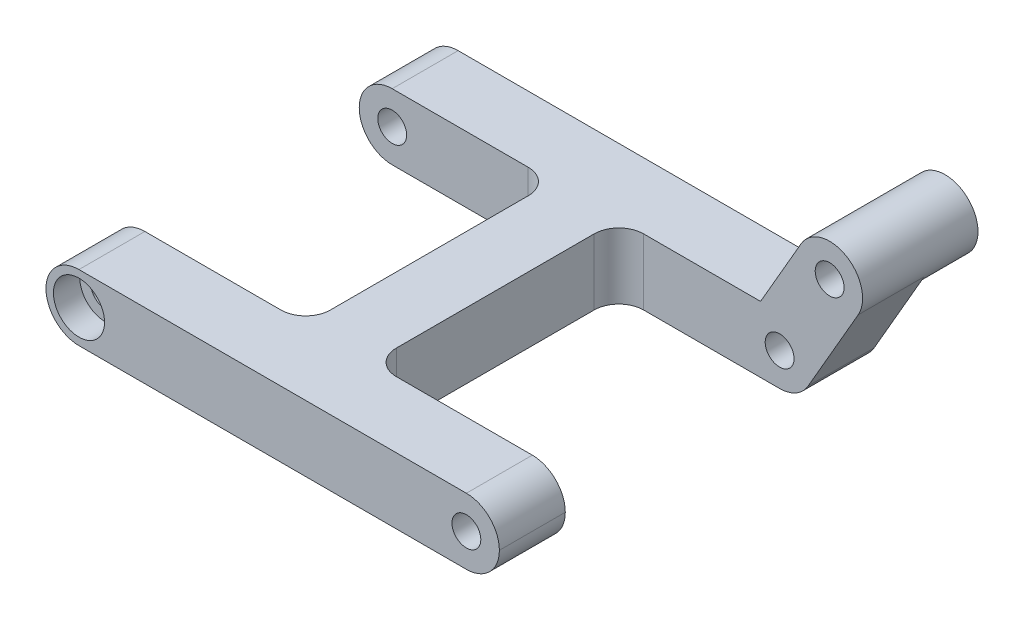
ISO-10303-21;
HEADER;
FILE_DESCRIPTION(('STEP AP214'),'2;1');
FILE_NAME('part.step','',(''),(''),'','','');
FILE_SCHEMA(('AUTOMOTIVE_DESIGN { 1 0 10303 214 1 1 1 1 }'));
ENDSEC;
DATA;
#1=APPLICATION_CONTEXT('core data for automotive mechanical design processes');
#2=APPLICATION_PROTOCOL_DEFINITION('international standard','automotive_design',2000,#1);
#3=PRODUCT_CONTEXT('',#1,'mechanical');
#4=PRODUCT('Part','Part','',(#3));
#5=PRODUCT_RELATED_PRODUCT_CATEGORY('part','',(#4));
#6=PRODUCT_DEFINITION_FORMATION('','',#4);
#7=PRODUCT_DEFINITION_CONTEXT('part definition',#1,'design');
#8=PRODUCT_DEFINITION('design','',#6,#7);
#9=PRODUCT_DEFINITION_SHAPE('','',#8);
#10=(LENGTH_UNIT() NAMED_UNIT(*) SI_UNIT(.MILLI.,.METRE.));
#11=(NAMED_UNIT(*) PLANE_ANGLE_UNIT() SI_UNIT($,.RADIAN.));
#12=(NAMED_UNIT(*) SI_UNIT($,.STERADIAN.) SOLID_ANGLE_UNIT());
#13=UNCERTAINTY_MEASURE_WITH_UNIT(LENGTH_MEASURE(1.E-05),#10,'distance_accuracy_value','');
#14=(GEOMETRIC_REPRESENTATION_CONTEXT(3) GLOBAL_UNCERTAINTY_ASSIGNED_CONTEXT((#13)) GLOBAL_UNIT_ASSIGNED_CONTEXT((#10,
#11,#12)) REPRESENTATION_CONTEXT('',''));
#15=CARTESIAN_POINT('',(0.,0.,0.));
#16=DIRECTION('',(0.,0.,1.));
#17=DIRECTION('',(1.,0.,0.));
#18=AXIS2_PLACEMENT_3D('',#15,#16,#17);
#19=CARTESIAN_POINT('',(-23.5,1.3965925355343E-13,-23.));
#20=DIRECTION('',(0.,0.,1.));
#21=DIRECTION('',(1.,0.,0.));
#22=AXIS2_PLACEMENT_3D('',#19,#20,#21);
#23=CYLINDRICAL_SURFACE('',#22,1.74999999999996);
#24=CARTESIAN_POINT('',(-23.5,1.3965925355343E-13,15.));
#25=DIRECTION('',(0.,0.,1.));
#26=DIRECTION('',(1.,0.,0.));
#27=AXIS2_PLACEMENT_3D('',#24,#25,#26);
#28=CIRCLE('',#27,1.74999999999996);
#29=CARTESIAN_POINT('',(-21.75,1.3965925355343E-13,15.));
#30=VERTEX_POINT('',#29);
#31=EDGE_CURVE('E231',#30,#30,#28,.T.);
#32=ORIENTED_EDGE('',*,*,#31,.F.);
#33=EDGE_LOOP('',(#32));
#34=FACE_BOUND('',#33,.T.);
#35=CARTESIAN_POINT('',(-23.5,1.3965925355343E-13,19.8));
#36=DIRECTION('',(0.,0.,1.));
#37=DIRECTION('',(1.,0.,0.));
#38=AXIS2_PLACEMENT_3D('',#35,#36,#37);
#39=CIRCLE('',#38,1.74999999999996);
#40=CARTESIAN_POINT('',(-21.75,1.3965925355343E-13,19.8));
#41=VERTEX_POINT('',#40);
#42=EDGE_CURVE('E40',#41,#41,#39,.F.);
#43=ORIENTED_EDGE('',*,*,#42,.F.);
#44=EDGE_LOOP('',(#43));
#45=FACE_BOUND('',#44,.T.);
#46=ADVANCED_FACE('F36',(#34,#45),#23,.F.);
#47=CARTESIAN_POINT('',(23.5,0.,-15.));
#48=DIRECTION('',(0.,0.,-1.));
#49=DIRECTION('',(-1.,0.,0.));
#50=AXIS2_PLACEMENT_3D('',#47,#48,#49);
#51=CYLINDRICAL_SURFACE('',#50,4.);
#52=CARTESIAN_POINT('',(23.5,0.,-23.));
#53=DIRECTION('',(0.,0.,1.));
#54=DIRECTION('',(1.,0.,0.));
#55=AXIS2_PLACEMENT_3D('',#52,#53,#54);
#56=CIRCLE('',#55,4.);
#57=CARTESIAN_POINT('',(26.9641016151377,-1.99999999999999,-23.));
#58=VERTEX_POINT('',#57);
#59=CARTESIAN_POINT('',(23.5,-4.,-23.));
#60=VERTEX_POINT('',#59);
#61=EDGE_CURVE('E308',#58,#60,#56,.F.);
#62=ORIENTED_EDGE('',*,*,#61,.F.);
#63=DIRECTION('',(0.,0.,-1.));
#64=VECTOR('',#63,1.);
#65=CARTESIAN_POINT('',(26.9641016151378,-1.99999999999999,-15.));
#66=LINE('',#65,#64);
#67=CARTESIAN_POINT('',(26.9641016151378,-1.99999999999999,-15.));
#68=VERTEX_POINT('',#67);
#69=EDGE_CURVE('E189',#68,#58,#66,.T.);
#70=ORIENTED_EDGE('',*,*,#69,.F.);
#71=CARTESIAN_POINT('',(23.5,0.,-15.));
#72=DIRECTION('',(0.,0.,-1.));
#73=DIRECTION('',(-1.,0.,0.));
#74=AXIS2_PLACEMENT_3D('',#71,#72,#73);
#75=CIRCLE('',#74,4.);
#76=CARTESIAN_POINT('',(23.5,-4.,-15.));
#77=VERTEX_POINT('',#76);
#78=EDGE_CURVE('E334',#77,#68,#75,.F.);
#79=ORIENTED_EDGE('',*,*,#78,.F.);
#80=DIRECTION('',(0.,0.,-1.));
#81=VECTOR('',#80,1.);
#82=CARTESIAN_POINT('',(23.5,-4.,0.));
#83=LINE('',#82,#81);
#84=EDGE_CURVE('E299',#60,#77,#83,.F.);
#85=ORIENTED_EDGE('',*,*,#84,.F.);
#86=EDGE_LOOP('',(#62,#70,#79,#85));
#87=FACE_BOUND('',#86,.T.);
#88=ADVANCED_FACE('F465',(#87),#51,.T.);
#89=CARTESIAN_POINT('',(-4.,4.,-15.));
#90=DIRECTION('',(0.,0.,-1.));
#91=DIRECTION('',(-1.,0.,0.));
#92=AXIS2_PLACEMENT_3D('',#89,#90,#91);
#93=PLANE('',#92);
#94=CARTESIAN_POINT('',(-23.5,1.3965925355343E-13,-15.));
#95=DIRECTION('',(0.,0.,-1.));
#96=DIRECTION('',(-1.,0.,0.));
#97=AXIS2_PLACEMENT_3D('',#94,#95,#96);
#98=CIRCLE('',#97,1.74999999999996);
#99=CARTESIAN_POINT('',(-25.25,1.3965925355343E-13,-15.));
#100=VERTEX_POINT('',#99);
#101=EDGE_CURVE('E241',#100,#100,#98,.T.);
#102=ORIENTED_EDGE('',*,*,#101,.T.);
#103=EDGE_LOOP('',(#102));
#104=FACE_BOUND('',#103,.T.);
#105=DIRECTION('',(1.,0.,0.));
#106=VECTOR('',#105,1.);
#107=CARTESIAN_POINT('',(-4.,-4.,-15.));
#108=LINE('',#107,#106);
#109=CARTESIAN_POINT('',(-23.5,-4.,-15.));
#110=VERTEX_POINT('',#109);
#111=CARTESIAN_POINT('',(-7.,-4.,-15.));
#112=VERTEX_POINT('',#111);
#113=EDGE_CURVE('E250',#110,#112,#108,.T.);
#114=ORIENTED_EDGE('',*,*,#113,.T.);
#115=DIRECTION('',(0.,-1.,0.));
#116=VECTOR('',#115,1.);
#117=CARTESIAN_POINT('',(-7.,4.,-15.));
#118=LINE('',#117,#116);
#119=CARTESIAN_POINT('',(-7.,4.,-15.));
#120=VERTEX_POINT('',#119);
#121=EDGE_CURVE('E356',#112,#120,#118,.F.);
#122=ORIENTED_EDGE('',*,*,#121,.T.);
#123=DIRECTION('',(1.,0.,0.));
#124=VECTOR('',#123,1.);
#125=CARTESIAN_POINT('',(-4.,4.,-15.));
#126=LINE('',#125,#124);
#127=CARTESIAN_POINT('',(-23.5,4.,-15.));
#128=VERTEX_POINT('',#127);
#129=EDGE_CURVE('E251',#128,#120,#126,.T.);
#130=ORIENTED_EDGE('',*,*,#129,.F.);
#131=CARTESIAN_POINT('',(-23.5,0.,-15.));
#132=DIRECTION('',(0.,0.,-1.));
#133=DIRECTION('',(-1.,0.,0.));
#134=AXIS2_PLACEMENT_3D('',#131,#132,#133);
#135=CIRCLE('',#134,4.);
#136=CARTESIAN_POINT('',(-27.5,0.,-15.));
#137=VERTEX_POINT('',#136);
#138=EDGE_CURVE('E272',#128,#137,#135,.F.);
#139=ORIENTED_EDGE('',*,*,#138,.T.);
#140=CARTESIAN_POINT('',(-23.5,0.,-15.));
#141=DIRECTION('',(0.,0.,-1.));
#142=DIRECTION('',(-1.,0.,0.));
#143=AXIS2_PLACEMENT_3D('',#140,#141,#142);
#144=CIRCLE('',#143,4.);
#145=EDGE_CURVE('E294',#137,#110,#144,.F.);
#146=ORIENTED_EDGE('',*,*,#145,.T.);
#147=EDGE_LOOP('',(#114,#122,#130,#139,#146));
#148=FACE_BOUND('',#147,.T.);
#149=ADVANCED_FACE('F411',(#104,#148),#93,.F.);
#150=CARTESIAN_POINT('',(-4.,4.,15.));
#151=DIRECTION('',(1.,0.,0.));
#152=DIRECTION('',(0.,0.,-1.));
#153=AXIS2_PLACEMENT_3D('',#150,#151,#152);
#154=PLANE('',#153);
#155=DIRECTION('',(0.,0.,1.));
#156=VECTOR('',#155,1.);
#157=CARTESIAN_POINT('',(-4.,-4.,15.));
#158=LINE('',#157,#156);
#159=CARTESIAN_POINT('',(-4.,-4.,-12.));
#160=VERTEX_POINT('',#159);
#161=CARTESIAN_POINT('',(-4.,-4.,12.));
#162=VERTEX_POINT('',#161);
#163=EDGE_CURVE('E275',#160,#162,#158,.T.);
#164=ORIENTED_EDGE('',*,*,#163,.T.);
#165=DIRECTION('',(0.,-1.,0.));
#166=VECTOR('',#165,1.);
#167=CARTESIAN_POINT('',(-4.,4.,12.));
#168=LINE('',#167,#166);
#169=CARTESIAN_POINT('',(-4.,4.,12.));
#170=VERTEX_POINT('',#169);
#171=EDGE_CURVE('E354',#162,#170,#168,.F.);
#172=ORIENTED_EDGE('',*,*,#171,.T.);
#173=DIRECTION('',(0.,0.,1.));
#174=VECTOR('',#173,1.);
#175=CARTESIAN_POINT('',(-4.,4.,15.));
#176=LINE('',#175,#174);
#177=CARTESIAN_POINT('',(-4.,4.,-12.));
#178=VERTEX_POINT('',#177);
#179=EDGE_CURVE('E254',#178,#170,#176,.T.);
#180=ORIENTED_EDGE('',*,*,#179,.F.);
#181=DIRECTION('',(0.,-1.,0.));
#182=VECTOR('',#181,1.);
#183=CARTESIAN_POINT('',(-4.,-4.,-12.));
#184=LINE('',#183,#182);
#185=EDGE_CURVE('E351',#178,#160,#184,.T.);
#186=ORIENTED_EDGE('',*,*,#185,.T.);
#187=EDGE_LOOP('',(#164,#172,#180,#186));
#188=FACE_BOUND('',#187,.T.);
#189=ADVANCED_FACE('F419',(#188),#154,.F.);
#190=CARTESIAN_POINT('',(-27.5,4.,15.));
#191=DIRECTION('',(0.,0.,1.));
#192=DIRECTION('',(1.,0.,0.));
#193=AXIS2_PLACEMENT_3D('',#190,#191,#192);
#194=PLANE('',#193);
#195=ORIENTED_EDGE('',*,*,#31,.T.);
#196=EDGE_LOOP('',(#195));
#197=FACE_BOUND('',#196,.T.);
#198=DIRECTION('',(-1.,0.,0.));
#199=VECTOR('',#198,1.);
#200=CARTESIAN_POINT('',(-27.5,4.,15.));
#201=LINE('',#200,#199);
#202=CARTESIAN_POINT('',(-7.,4.,15.));
#203=VERTEX_POINT('',#202);
#204=CARTESIAN_POINT('',(-23.5,4.,15.));
#205=VERTEX_POINT('',#204);
#206=EDGE_CURVE('E258',#203,#205,#201,.T.);
#207=ORIENTED_EDGE('',*,*,#206,.F.);
#208=DIRECTION('',(0.,-1.,0.));
#209=VECTOR('',#208,1.);
#210=CARTESIAN_POINT('',(-7.,-4.,15.));
#211=LINE('',#210,#209);
#212=CARTESIAN_POINT('',(-7.,-4.,15.));
#213=VERTEX_POINT('',#212);
#214=EDGE_CURVE('E341',#203,#213,#211,.T.);
#215=ORIENTED_EDGE('',*,*,#214,.T.);
#216=DIRECTION('',(-1.,0.,0.));
#217=VECTOR('',#216,1.);
#218=CARTESIAN_POINT('',(-27.5,-4.,15.));
#219=LINE('',#218,#217);
#220=CARTESIAN_POINT('',(-23.5,-4.,15.));
#221=VERTEX_POINT('',#220);
#222=EDGE_CURVE('E278',#213,#221,#219,.T.);
#223=ORIENTED_EDGE('',*,*,#222,.T.);
#224=CARTESIAN_POINT('',(-23.5,0.,15.));
#225=DIRECTION('',(0.,0.,1.));
#226=DIRECTION('',(1.,0.,0.));
#227=AXIS2_PLACEMENT_3D('',#224,#225,#226);
#228=CIRCLE('',#227,4.);
#229=CARTESIAN_POINT('',(-27.5,0.,15.));
#230=VERTEX_POINT('',#229);
#231=EDGE_CURVE('E332',#221,#230,#228,.F.);
#232=ORIENTED_EDGE('',*,*,#231,.T.);
#233=CARTESIAN_POINT('',(-23.5,0.,15.));
#234=DIRECTION('',(0.,0.,1.));
#235=DIRECTION('',(1.,0.,0.));
#236=AXIS2_PLACEMENT_3D('',#233,#234,#235);
#237=CIRCLE('',#236,4.);
#238=EDGE_CURVE('E329',#230,#205,#237,.F.);
#239=ORIENTED_EDGE('',*,*,#238,.T.);
#240=EDGE_LOOP('',(#207,#215,#223,#232,#239));
#241=FACE_BOUND('',#240,.T.);
#242=ADVANCED_FACE('F427',(#197,#241),#194,.F.);
#243=CARTESIAN_POINT('',(27.5,4.,23.));
#244=DIRECTION('',(0.,0.,-1.));
#245=DIRECTION('',(-1.,0.,0.));
#246=AXIS2_PLACEMENT_3D('',#243,#244,#245);
#247=PLANE('',#246);
#248=CARTESIAN_POINT('',(-23.5,1.3965925355343E-13,23.));
#249=DIRECTION('',(0.,0.,1.));
#250=DIRECTION('',(1.,0.,0.));
#251=AXIS2_PLACEMENT_3D('',#248,#249,#250);
#252=CIRCLE('',#251,3.1);
#253=CARTESIAN_POINT('',(-20.4,1.3965925355343E-13,23.));
#254=VERTEX_POINT('',#253);
#255=EDGE_CURVE('E814',#254,#254,#252,.T.);
#256=ORIENTED_EDGE('',*,*,#255,.F.);
#257=EDGE_LOOP('',(#256));
#258=FACE_BOUND('',#257,.T.);
#259=CARTESIAN_POINT('',(23.5,0.,23.));
#260=DIRECTION('',(0.,0.,1.));
#261=DIRECTION('',(1.,0.,0.));
#262=AXIS2_PLACEMENT_3D('',#259,#260,#261);
#263=CIRCLE('',#262,1.75);
#264=CARTESIAN_POINT('',(25.25,0.,23.));
#265=VERTEX_POINT('',#264);
#266=EDGE_CURVE('E232',#265,#265,#263,.T.);
#267=ORIENTED_EDGE('',*,*,#266,.F.);
#268=EDGE_LOOP('',(#267));
#269=FACE_BOUND('',#268,.T.);
#270=CARTESIAN_POINT('',(-23.5,0.,23.));
#271=DIRECTION('',(0.,0.,-1.));
#272=DIRECTION('',(-1.,0.,0.));
#273=AXIS2_PLACEMENT_3D('',#270,#271,#272);
#274=CIRCLE('',#273,4.);
#275=CARTESIAN_POINT('',(-23.5,4.,23.));
#276=VERTEX_POINT('',#275);
#277=CARTESIAN_POINT('',(-27.5,0.,23.));
#278=VERTEX_POINT('',#277);
#279=EDGE_CURVE('E325',#276,#278,#274,.F.);
#280=ORIENTED_EDGE('',*,*,#279,.T.);
#281=CARTESIAN_POINT('',(-23.5,0.,23.));
#282=DIRECTION('',(0.,0.,-1.));
#283=DIRECTION('',(-1.,0.,0.));
#284=AXIS2_PLACEMENT_3D('',#281,#282,#283);
#285=CIRCLE('',#284,4.);
#286=CARTESIAN_POINT('',(-23.5,-4.,23.));
#287=VERTEX_POINT('',#286);
#288=EDGE_CURVE('E327',#278,#287,#285,.F.);
#289=ORIENTED_EDGE('',*,*,#288,.T.);
#290=DIRECTION('',(1.,0.,0.));
#291=VECTOR('',#290,1.);
#292=CARTESIAN_POINT('',(27.5,-4.,23.));
#293=LINE('',#292,#291);
#294=CARTESIAN_POINT('',(23.5,-4.,23.));
#295=VERTEX_POINT('',#294);
#296=EDGE_CURVE('E280',#287,#295,#293,.T.);
#297=ORIENTED_EDGE('',*,*,#296,.T.);
#298=CARTESIAN_POINT('',(23.5,0.,23.));
#299=DIRECTION('',(0.,0.,-1.));
#300=DIRECTION('',(-1.,0.,0.));
#301=AXIS2_PLACEMENT_3D('',#298,#299,#300);
#302=CIRCLE('',#301,4.);
#303=CARTESIAN_POINT('',(27.5,0.,23.));
#304=VERTEX_POINT('',#303);
#305=EDGE_CURVE('E323',#295,#304,#302,.F.);
#306=ORIENTED_EDGE('',*,*,#305,.T.);
#307=CARTESIAN_POINT('',(23.5,0.,23.));
#308=DIRECTION('',(0.,0.,-1.));
#309=DIRECTION('',(-1.,0.,0.));
#310=AXIS2_PLACEMENT_3D('',#307,#308,#309);
#311=CIRCLE('',#310,4.);
#312=CARTESIAN_POINT('',(23.5,4.,23.));
#313=VERTEX_POINT('',#312);
#314=EDGE_CURVE('E321',#304,#313,#311,.F.);
#315=ORIENTED_EDGE('',*,*,#314,.T.);
#316=DIRECTION('',(1.,0.,0.));
#317=VECTOR('',#316,1.);
#318=CARTESIAN_POINT('',(27.5,4.,23.));
#319=LINE('',#318,#317);
#320=EDGE_CURVE('E260',#276,#313,#319,.T.);
#321=ORIENTED_EDGE('',*,*,#320,.F.);
#322=EDGE_LOOP('',(#280,#289,#297,#306,#315,#321));
#323=FACE_BOUND('',#322,.T.);
#324=ADVANCED_FACE('F439',(#258,#269,#323),#247,.F.);
#325=CARTESIAN_POINT('',(27.5,4.,15.));
#326=DIRECTION('',(0.,0.,1.));
#327=DIRECTION('',(1.,0.,0.));
#328=AXIS2_PLACEMENT_3D('',#325,#326,#327);
#329=PLANE('',#328);
#330=CARTESIAN_POINT('',(23.5,0.,15.));
#331=DIRECTION('',(0.,0.,1.));
#332=DIRECTION('',(1.,0.,0.));
#333=AXIS2_PLACEMENT_3D('',#330,#331,#332);
#334=CIRCLE('',#333,1.75);
#335=CARTESIAN_POINT('',(25.25,0.,15.));
#336=VERTEX_POINT('',#335);
#337=EDGE_CURVE('E247',#336,#336,#334,.T.);
#338=ORIENTED_EDGE('',*,*,#337,.T.);
#339=EDGE_LOOP('',(#338));
#340=FACE_BOUND('',#339,.T.);
#341=DIRECTION('',(-1.,0.,0.));
#342=VECTOR('',#341,1.);
#343=CARTESIAN_POINT('',(27.5,-4.,15.));
#344=LINE('',#343,#342);
#345=CARTESIAN_POINT('',(23.5,-4.,15.));
#346=VERTEX_POINT('',#345);
#347=CARTESIAN_POINT('',(7.00000000000001,-4.,15.));
#348=VERTEX_POINT('',#347);
#349=EDGE_CURVE('E283',#346,#348,#344,.T.);
#350=ORIENTED_EDGE('',*,*,#349,.T.);
#351=DIRECTION('',(0.,-1.,0.));
#352=VECTOR('',#351,1.);
#353=CARTESIAN_POINT('',(7.,4.,15.));
#354=LINE('',#353,#352);
#355=CARTESIAN_POINT('',(7.00000000000001,4.,15.));
#356=VERTEX_POINT('',#355);
#357=EDGE_CURVE('E363',#348,#356,#354,.F.);
#358=ORIENTED_EDGE('',*,*,#357,.T.);
#359=DIRECTION('',(-1.,0.,0.));
#360=VECTOR('',#359,1.);
#361=CARTESIAN_POINT('',(27.5,4.,15.));
#362=LINE('',#361,#360);
#363=CARTESIAN_POINT('',(23.5,4.,15.));
#364=VERTEX_POINT('',#363);
#365=EDGE_CURVE('E263',#364,#356,#362,.T.);
#366=ORIENTED_EDGE('',*,*,#365,.F.);
#367=CARTESIAN_POINT('',(23.5,0.,15.));
#368=DIRECTION('',(0.,0.,1.));
#369=DIRECTION('',(1.,0.,0.));
#370=AXIS2_PLACEMENT_3D('',#367,#368,#369);
#371=CIRCLE('',#370,4.);
#372=CARTESIAN_POINT('',(27.5,0.,15.));
#373=VERTEX_POINT('',#372);
#374=EDGE_CURVE('E337',#364,#373,#371,.F.);
#375=ORIENTED_EDGE('',*,*,#374,.T.);
#376=CARTESIAN_POINT('',(23.5,0.,15.));
#377=DIRECTION('',(0.,0.,1.));
#378=DIRECTION('',(1.,0.,0.));
#379=AXIS2_PLACEMENT_3D('',#376,#377,#378);
#380=CIRCLE('',#379,4.);
#381=EDGE_CURVE('E339',#373,#346,#380,.F.);
#382=ORIENTED_EDGE('',*,*,#381,.T.);
#383=EDGE_LOOP('',(#350,#358,#366,#375,#382));
#384=FACE_BOUND('',#383,.T.);
#385=ADVANCED_FACE('F451',(#340,#384),#329,.F.);
#386=CARTESIAN_POINT('',(4.,4.,15.));
#387=DIRECTION('',(-1.,0.,0.));
#388=DIRECTION('',(0.,0.,1.));
#389=AXIS2_PLACEMENT_3D('',#386,#387,#388);
#390=PLANE('',#389);
#391=DIRECTION('',(0.,0.,-1.));
#392=VECTOR('',#391,1.);
#393=CARTESIAN_POINT('',(4.,4.,15.));
#394=LINE('',#393,#392);
#395=CARTESIAN_POINT('',(4.,4.,12.));
#396=VERTEX_POINT('',#395);
#397=CARTESIAN_POINT('',(4.,4.,-12.));
#398=VERTEX_POINT('',#397);
#399=EDGE_CURVE('E266',#396,#398,#394,.T.);
#400=ORIENTED_EDGE('',*,*,#399,.F.);
#401=DIRECTION('',(0.,-1.,0.));
#402=VECTOR('',#401,1.);
#403=CARTESIAN_POINT('',(4.,-4.,12.));
#404=LINE('',#403,#402);
#405=CARTESIAN_POINT('',(4.,-4.,12.));
#406=VERTEX_POINT('',#405);
#407=EDGE_CURVE('E360',#396,#406,#404,.T.);
#408=ORIENTED_EDGE('',*,*,#407,.T.);
#409=DIRECTION('',(0.,0.,-1.));
#410=VECTOR('',#409,1.);
#411=CARTESIAN_POINT('',(4.,-4.,15.));
#412=LINE('',#411,#410);
#413=CARTESIAN_POINT('',(4.,-4.,-12.));
#414=VERTEX_POINT('',#413);
#415=EDGE_CURVE('E286',#406,#414,#412,.T.);
#416=ORIENTED_EDGE('',*,*,#415,.T.);
#417=DIRECTION('',(0.,-1.,0.));
#418=VECTOR('',#417,1.);
#419=CARTESIAN_POINT('',(4.,4.,-12.));
#420=LINE('',#419,#418);
#421=EDGE_CURVE('E358',#414,#398,#420,.F.);
#422=ORIENTED_EDGE('',*,*,#421,.T.);
#423=EDGE_LOOP('',(#400,#408,#416,#422));
#424=FACE_BOUND('',#423,.T.);
#425=ADVANCED_FACE('F392',(#424),#390,.F.);
#426=CARTESIAN_POINT('',(4.,4.,-15.));
#427=DIRECTION('',(0.,0.,-1.));
#428=DIRECTION('',(-1.,0.,0.));
#429=AXIS2_PLACEMENT_3D('',#426,#427,#428);
#430=PLANE('',#429);
#431=DIRECTION('',(0.499999999999997,0.86602540378444,0.));
#432=VECTOR('',#431,1.);
#433=CARTESIAN_POINT('',(26.1037132960612,12.5097637171206,-15.));
#434=LINE('',#433,#432);
#435=CARTESIAN_POINT('',(21.1905989232415,4.,-15.));
#436=VERTEX_POINT('',#435);
#437=CARTESIAN_POINT('',(26.1037132960612,12.5097637171206,-15.));
#438=VERTEX_POINT('',#437);
#439=EDGE_CURVE('E203',#436,#438,#434,.T.);
#440=ORIENTED_EDGE('',*,*,#439,.F.);
#441=DIRECTION('',(1.,0.,0.));
#442=VECTOR('',#441,1.);
#443=CARTESIAN_POINT('',(4.,4.,-15.));
#444=LINE('',#443,#442);
#445=CARTESIAN_POINT('',(7.,4.,-15.));
#446=VERTEX_POINT('',#445);
#447=EDGE_CURVE('E268',#446,#436,#444,.T.);
#448=ORIENTED_EDGE('',*,*,#447,.F.);
#449=DIRECTION('',(0.,-1.,0.));
#450=VECTOR('',#449,1.);
#451=CARTESIAN_POINT('',(7.,-4.,-15.));
#452=LINE('',#451,#450);
#453=CARTESIAN_POINT('',(7.,-4.,-15.));
#454=VERTEX_POINT('',#453);
#455=EDGE_CURVE('E365',#446,#454,#452,.T.);
#456=ORIENTED_EDGE('',*,*,#455,.T.);
#457=DIRECTION('',(1.,0.,0.));
#458=VECTOR('',#457,1.);
#459=CARTESIAN_POINT('',(4.,-4.,-15.));
#460=LINE('',#459,#458);
#461=EDGE_CURVE('E289',#454,#77,#460,.T.);
#462=ORIENTED_EDGE('',*,*,#461,.T.);
#463=ORIENTED_EDGE('',*,*,#78,.T.);
#464=DIRECTION('',(-0.499999999999998,-0.866025403784439,0.));
#465=VECTOR('',#464,1.);
#466=CARTESIAN_POINT('',(33.0319165263367,8.50976371712065,-15.));
#467=LINE('',#466,#465);
#468=CARTESIAN_POINT('',(33.0319165263367,8.50976371712065,-15.));
#469=VERTEX_POINT('',#468);
#470=EDGE_CURVE('E220',#469,#68,#467,.T.);
#471=ORIENTED_EDGE('',*,*,#470,.F.);
#472=CARTESIAN_POINT('',(29.5678149111989,10.5097637171206,-15.));
#473=DIRECTION('',(0.,0.,-1.));
#474=DIRECTION('',(-1.,0.,0.));
#475=AXIS2_PLACEMENT_3D('',#472,#473,#474);
#476=CIRCLE('',#475,4.);
#477=EDGE_CURVE('E202',#438,#469,#476,.T.);
#478=ORIENTED_EDGE('',*,*,#477,.F.);
#479=EDGE_LOOP('',(#440,#448,#456,#462,#463,#471,#478));
#480=FACE_BOUND('',#479,.T.);
#481=CARTESIAN_POINT('',(23.5,0.,-15.));
#482=DIRECTION('',(0.,0.,-1.));
#483=DIRECTION('',(-1.,0.,0.));
#484=AXIS2_PLACEMENT_3D('',#481,#482,#483);
#485=CIRCLE('',#484,1.75);
#486=CARTESIAN_POINT('',(21.75,0.,-15.));
#487=VERTEX_POINT('',#486);
#488=EDGE_CURVE('E244',#487,#487,#485,.T.);
#489=ORIENTED_EDGE('',*,*,#488,.T.);
#490=EDGE_LOOP('',(#489));
#491=FACE_BOUND('',#490,.T.);
#492=CARTESIAN_POINT('',(29.5678149111989,10.5097637171206,-15.));
#493=DIRECTION('',(0.,0.,-1.));
#494=DIRECTION('',(-1.,0.,0.));
#495=AXIS2_PLACEMENT_3D('',#492,#493,#494);
#496=CIRCLE('',#495,1.75);
#497=CARTESIAN_POINT('',(27.8178149111989,10.5097637171206,-15.));
#498=VERTEX_POINT('',#497);
#499=EDGE_CURVE('E192',#498,#498,#496,.T.);
#500=ORIENTED_EDGE('',*,*,#499,.T.);
#501=EDGE_LOOP('',(#500));
#502=FACE_BOUND('',#501,.T.);
#503=ADVANCED_FACE('F396',(#480,#491,#502),#430,.F.);
#504=CARTESIAN_POINT('',(27.5,4.,-23.));
#505=DIRECTION('',(0.,0.,1.));
#506=DIRECTION('',(1.,0.,0.));
#507=AXIS2_PLACEMENT_3D('',#504,#505,#506);
#508=PLANE('',#507);
#509=CARTESIAN_POINT('',(-23.5,1.3965925355343E-13,-23.));
#510=DIRECTION('',(0.,0.,1.));
#511=DIRECTION('',(1.,0.,0.));
#512=AXIS2_PLACEMENT_3D('',#509,#510,#511);
#513=CIRCLE('',#512,1.74999999999996);
#514=CARTESIAN_POINT('',(-21.75,1.3965925355343E-13,-23.));
#515=VERTEX_POINT('',#514);
#516=EDGE_CURVE('E235',#515,#515,#513,.T.);
#517=ORIENTED_EDGE('',*,*,#516,.T.);
#518=EDGE_LOOP('',(#517));
#519=FACE_BOUND('',#518,.T.);
#520=DIRECTION('',(0.499999999999997,0.86602540378444,0.));
#521=VECTOR('',#520,1.);
#522=CARTESIAN_POINT('',(26.1037132960612,12.5097637171206,-23.));
#523=LINE('',#522,#521);
#524=CARTESIAN_POINT('',(21.1905989232415,4.,-23.));
#525=VERTEX_POINT('',#524);
#526=CARTESIAN_POINT('',(26.1037132960612,12.5097637171206,-23.));
#527=VERTEX_POINT('',#526);
#528=EDGE_CURVE('E191',#525,#527,#523,.T.);
#529=ORIENTED_EDGE('',*,*,#528,.T.);
#530=CARTESIAN_POINT('',(29.5678149111989,10.5097637171206,-23.));
#531=DIRECTION('',(0.,0.,1.));
#532=DIRECTION('',(1.,0.,0.));
#533=AXIS2_PLACEMENT_3D('',#530,#531,#532);
#534=CIRCLE('',#533,4.);
#535=CARTESIAN_POINT('',(33.0319165263367,8.50976371712065,-23.));
#536=VERTEX_POINT('',#535);
#537=EDGE_CURVE('E200',#527,#536,#534,.T.);
#538=ORIENTED_EDGE('',*,*,#537,.T.);
#539=DIRECTION('',(-0.499999999999998,-0.866025403784439,0.));
#540=VECTOR('',#539,1.);
#541=CARTESIAN_POINT('',(33.0319165263367,8.50976371712065,-23.));
#542=LINE('',#541,#540);
#543=EDGE_CURVE('E52',#536,#58,#542,.T.);
#544=ORIENTED_EDGE('',*,*,#543,.T.);
#545=ORIENTED_EDGE('',*,*,#61,.T.);
#546=DIRECTION('',(-1.,0.,0.));
#547=VECTOR('',#546,1.);
#548=CARTESIAN_POINT('',(27.5,-4.,-23.));
#549=LINE('',#548,#547);
#550=CARTESIAN_POINT('',(-23.5,-4.,-23.));
#551=VERTEX_POINT('',#550);
#552=EDGE_CURVE('E255',#60,#551,#549,.T.);
#553=ORIENTED_EDGE('',*,*,#552,.T.);
#554=CARTESIAN_POINT('',(-23.5,0.,-23.));
#555=DIRECTION('',(0.,0.,1.));
#556=DIRECTION('',(1.,0.,0.));
#557=AXIS2_PLACEMENT_3D('',#554,#555,#556);
#558=CIRCLE('',#557,4.);
#559=CARTESIAN_POINT('',(-27.5,0.,-23.));
#560=VERTEX_POINT('',#559);
#561=EDGE_CURVE('E313',#551,#560,#558,.F.);
#562=ORIENTED_EDGE('',*,*,#561,.T.);
#563=CARTESIAN_POINT('',(-23.5,0.,-23.));
#564=DIRECTION('',(0.,0.,1.));
#565=DIRECTION('',(1.,0.,0.));
#566=AXIS2_PLACEMENT_3D('',#563,#564,#565);
#567=CIRCLE('',#566,4.);
#568=CARTESIAN_POINT('',(-23.5,4.,-23.));
#569=VERTEX_POINT('',#568);
#570=EDGE_CURVE('E310',#560,#569,#567,.F.);
#571=ORIENTED_EDGE('',*,*,#570,.T.);
#572=DIRECTION('',(-1.,0.,0.));
#573=VECTOR('',#572,1.);
#574=CARTESIAN_POINT('',(27.5,4.,-23.));
#575=LINE('',#574,#573);
#576=EDGE_CURVE('E270',#525,#569,#575,.T.);
#577=ORIENTED_EDGE('',*,*,#576,.F.);
#578=EDGE_LOOP('',(#529,#538,#544,#545,#553,#562,#571,#577));
#579=FACE_BOUND('',#578,.T.);
#580=CARTESIAN_POINT('',(23.5,0.,-23.));
#581=DIRECTION('',(0.,0.,1.));
#582=DIRECTION('',(1.,0.,0.));
#583=AXIS2_PLACEMENT_3D('',#580,#581,#582);
#584=CIRCLE('',#583,1.75);
#585=CARTESIAN_POINT('',(25.25,0.,-23.));
#586=VERTEX_POINT('',#585);
#587=EDGE_CURVE('E228',#586,#586,#584,.T.);
#588=ORIENTED_EDGE('',*,*,#587,.T.);
#589=EDGE_LOOP('',(#588));
#590=FACE_BOUND('',#589,.T.);
#591=ADVANCED_FACE('F205',(#519,#579,#590),#508,.F.);
#592=CARTESIAN_POINT('',(0.,4.,0.));
#593=DIRECTION('',(0.,1.,0.));
#594=DIRECTION('',(0.,0.,1.));
#595=AXIS2_PLACEMENT_3D('',#592,#593,#594);
#596=PLANE('',#595);
#597=DIRECTION('',(0.,0.,1.));
#598=VECTOR('',#597,1.);
#599=CARTESIAN_POINT('',(21.1905989232415,4.,0.));
#600=LINE('',#599,#598);
#601=EDGE_CURVE('E11',#525,#436,#600,.T.);
#602=ORIENTED_EDGE('',*,*,#601,.F.);
#603=ORIENTED_EDGE('',*,*,#576,.T.);
#604=DIRECTION('',(0.,0.,1.));
#605=VECTOR('',#604,1.);
#606=CARTESIAN_POINT('',(-23.5,4.,-15.));
#607=LINE('',#606,#605);
#608=EDGE_CURVE('E319',#569,#128,#607,.T.);
#609=ORIENTED_EDGE('',*,*,#608,.T.);
#610=ORIENTED_EDGE('',*,*,#129,.T.);
#611=CARTESIAN_POINT('',(-7.,4.,-12.));
#612=DIRECTION('',(0.,1.,0.));
#613=DIRECTION('',(0.,0.,1.));
#614=AXIS2_PLACEMENT_3D('',#611,#612,#613);
#615=CIRCLE('',#614,3.);
#616=EDGE_CURVE('E374',#120,#178,#615,.F.);
#617=ORIENTED_EDGE('',*,*,#616,.T.);
#618=ORIENTED_EDGE('',*,*,#179,.T.);
#619=CARTESIAN_POINT('',(-7.,4.,12.));
#620=DIRECTION('',(0.,1.,0.));
#621=DIRECTION('',(0.,0.,1.));
#622=AXIS2_PLACEMENT_3D('',#619,#620,#621);
#623=CIRCLE('',#622,3.);
#624=EDGE_CURVE('E370',#170,#203,#623,.F.);
#625=ORIENTED_EDGE('',*,*,#624,.T.);
#626=ORIENTED_EDGE('',*,*,#206,.T.);
#627=DIRECTION('',(0.,0.,1.));
#628=VECTOR('',#627,1.);
#629=CARTESIAN_POINT('',(-23.5,4.,23.));
#630=LINE('',#629,#628);
#631=EDGE_CURVE('E317',#205,#276,#630,.T.);
#632=ORIENTED_EDGE('',*,*,#631,.T.);
#633=ORIENTED_EDGE('',*,*,#320,.T.);
#634=DIRECTION('',(0.,0.,-1.));
#635=VECTOR('',#634,1.);
#636=CARTESIAN_POINT('',(23.5,4.,15.));
#637=LINE('',#636,#635);
#638=EDGE_CURVE('E315',#313,#364,#637,.T.);
#639=ORIENTED_EDGE('',*,*,#638,.T.);
#640=ORIENTED_EDGE('',*,*,#365,.T.);
#641=CARTESIAN_POINT('',(7.,4.,12.));
#642=DIRECTION('',(0.,1.,0.));
#643=DIRECTION('',(0.,0.,1.));
#644=AXIS2_PLACEMENT_3D('',#641,#642,#643);
#645=CIRCLE('',#644,3.);
#646=EDGE_CURVE('E378',#356,#396,#645,.F.);
#647=ORIENTED_EDGE('',*,*,#646,.T.);
#648=ORIENTED_EDGE('',*,*,#399,.T.);
#649=CARTESIAN_POINT('',(7.,4.,-12.));
#650=DIRECTION('',(0.,1.,0.));
#651=DIRECTION('',(0.,0.,1.));
#652=AXIS2_PLACEMENT_3D('',#649,#650,#651);
#653=CIRCLE('',#652,3.);
#654=EDGE_CURVE('E45',#398,#446,#653,.F.);
#655=ORIENTED_EDGE('',*,*,#654,.T.);
#656=ORIENTED_EDGE('',*,*,#447,.T.);
#657=EDGE_LOOP('',(#602,#603,#609,#610,#617,#618,#625,#626,#632,#633,#639,#640,#647,#648,#655,#656));
#658=FACE_BOUND('',#657,.T.);
#659=ADVANCED_FACE('F400',(#658),#596,.T.);
#660=CARTESIAN_POINT('',(0.,-4.,0.));
#661=DIRECTION('',(0.,1.,0.));
#662=DIRECTION('',(0.,0.,1.));
#663=AXIS2_PLACEMENT_3D('',#660,#661,#662);
#664=PLANE('',#663);
#665=ORIENTED_EDGE('',*,*,#113,.F.);
#666=DIRECTION('',(0.,0.,1.));
#667=VECTOR('',#666,1.);
#668=CARTESIAN_POINT('',(-23.5,-4.,0.));
#669=LINE('',#668,#667);
#670=EDGE_CURVE('E305',#110,#551,#669,.F.);
#671=ORIENTED_EDGE('',*,*,#670,.T.);
#672=ORIENTED_EDGE('',*,*,#552,.F.);
#673=ORIENTED_EDGE('',*,*,#84,.T.);
#674=ORIENTED_EDGE('',*,*,#461,.F.);
#675=CARTESIAN_POINT('',(7.,-4.,-12.));
#676=DIRECTION('',(0.,1.,0.));
#677=DIRECTION('',(0.,0.,1.));
#678=AXIS2_PLACEMENT_3D('',#675,#676,#677);
#679=CIRCLE('',#678,3.);
#680=EDGE_CURVE('E380',#454,#414,#679,.T.);
#681=ORIENTED_EDGE('',*,*,#680,.T.);
#682=ORIENTED_EDGE('',*,*,#415,.F.);
#683=CARTESIAN_POINT('',(7.,-4.,12.));
#684=DIRECTION('',(0.,1.,0.));
#685=DIRECTION('',(0.,0.,1.));
#686=AXIS2_PLACEMENT_3D('',#683,#684,#685);
#687=CIRCLE('',#686,3.);
#688=EDGE_CURVE('E376',#406,#348,#687,.T.);
#689=ORIENTED_EDGE('',*,*,#688,.T.);
#690=ORIENTED_EDGE('',*,*,#349,.F.);
#691=DIRECTION('',(0.,0.,-1.));
#692=VECTOR('',#691,1.);
#693=CARTESIAN_POINT('',(23.5,-4.,0.));
#694=LINE('',#693,#692);
#695=EDGE_CURVE('E296',#346,#295,#694,.F.);
#696=ORIENTED_EDGE('',*,*,#695,.T.);
#697=ORIENTED_EDGE('',*,*,#296,.F.);
#698=DIRECTION('',(0.,0.,1.));
#699=VECTOR('',#698,1.);
#700=CARTESIAN_POINT('',(-23.5,-4.,0.));
#701=LINE('',#700,#699);
#702=EDGE_CURVE('E302',#287,#221,#701,.F.);
#703=ORIENTED_EDGE('',*,*,#702,.T.);
#704=ORIENTED_EDGE('',*,*,#222,.F.);
#705=CARTESIAN_POINT('',(-7.,-4.,12.));
#706=DIRECTION('',(0.,1.,0.));
#707=DIRECTION('',(0.,0.,1.));
#708=AXIS2_PLACEMENT_3D('',#705,#706,#707);
#709=CIRCLE('',#708,3.);
#710=EDGE_CURVE('E368',#213,#162,#709,.T.);
#711=ORIENTED_EDGE('',*,*,#710,.T.);
#712=ORIENTED_EDGE('',*,*,#163,.F.);
#713=CARTESIAN_POINT('',(-7.,-4.,-12.));
#714=DIRECTION('',(0.,1.,0.));
#715=DIRECTION('',(0.,0.,1.));
#716=AXIS2_PLACEMENT_3D('',#713,#714,#715);
#717=CIRCLE('',#716,3.);
#718=EDGE_CURVE('E372',#160,#112,#717,.T.);
#719=ORIENTED_EDGE('',*,*,#718,.T.);
#720=EDGE_LOOP('',(#665,#671,#672,#673,#674,#681,#682,#689,#690,#696,#697,#703,#704,#711,#712,#719));
#721=FACE_BOUND('',#720,.T.);
#722=ADVANCED_FACE('F386',(#721),#664,.F.);
#723=ORIENTED_EDGE('',*,*,#516,.F.);
#724=EDGE_LOOP('',(#723));
#725=FACE_BOUND('',#724,.T.);
#726=ORIENTED_EDGE('',*,*,#101,.F.);
#727=EDGE_LOOP('',(#726));
#728=FACE_BOUND('',#727,.T.);
#729=ADVANCED_FACE('F468',(#725,#728),#23,.F.);
#730=CARTESIAN_POINT('',(23.5,0.,-23.));
#731=DIRECTION('',(0.,0.,1.));
#732=DIRECTION('',(1.,0.,0.));
#733=AXIS2_PLACEMENT_3D('',#730,#731,#732);
#734=CYLINDRICAL_SURFACE('',#733,1.75);
#735=ORIENTED_EDGE('',*,*,#587,.F.);
#736=EDGE_LOOP('',(#735));
#737=FACE_BOUND('',#736,.T.);
#738=ORIENTED_EDGE('',*,*,#488,.F.);
#739=EDGE_LOOP('',(#738));
#740=FACE_BOUND('',#739,.T.);
#741=ADVANCED_FACE('F479',(#737,#740),#734,.F.);
#742=ORIENTED_EDGE('',*,*,#266,.T.);
#743=EDGE_LOOP('',(#742));
#744=FACE_BOUND('',#743,.T.);
#745=ORIENTED_EDGE('',*,*,#337,.F.);
#746=EDGE_LOOP('',(#745));
#747=FACE_BOUND('',#746,.T.);
#748=ADVANCED_FACE('F485',(#744,#747),#734,.F.);
#749=CARTESIAN_POINT('',(-23.5,0.,0.));
#750=DIRECTION('',(0.,0.,-1.));
#751=DIRECTION('',(-1.,0.,0.));
#752=AXIS2_PLACEMENT_3D('',#749,#750,#751);
#753=CYLINDRICAL_SURFACE('',#752,4.);
#754=ORIENTED_EDGE('',*,*,#608,.F.);
#755=ORIENTED_EDGE('',*,*,#570,.F.);
#756=DIRECTION('',(0.,0.,1.));
#757=VECTOR('',#756,1.);
#758=CARTESIAN_POINT('',(-27.5,0.,-23.));
#759=LINE('',#758,#757);
#760=EDGE_CURVE('E238',#137,#560,#759,.F.);
#761=ORIENTED_EDGE('',*,*,#760,.F.);
#762=ORIENTED_EDGE('',*,*,#138,.F.);
#763=EDGE_LOOP('',(#754,#755,#761,#762));
#764=FACE_BOUND('',#763,.T.);
#765=ADVANCED_FACE('F407',(#764),#753,.T.);
#766=CARTESIAN_POINT('',(-23.5,0.,-15.));
#767=DIRECTION('',(0.,0.,1.));
#768=DIRECTION('',(1.,0.,0.));
#769=AXIS2_PLACEMENT_3D('',#766,#767,#768);
#770=CYLINDRICAL_SURFACE('',#769,4.);
#771=ORIENTED_EDGE('',*,*,#561,.F.);
#772=ORIENTED_EDGE('',*,*,#670,.F.);
#773=ORIENTED_EDGE('',*,*,#145,.F.);
#774=ORIENTED_EDGE('',*,*,#760,.T.);
#775=EDGE_LOOP('',(#771,#772,#773,#774));
#776=FACE_BOUND('',#775,.T.);
#777=ADVANCED_FACE('F500',(#776),#770,.T.);
#778=CARTESIAN_POINT('',(-23.5,0.,0.));
#779=DIRECTION('',(0.,0.,-1.));
#780=DIRECTION('',(-1.,0.,0.));
#781=AXIS2_PLACEMENT_3D('',#778,#779,#780);
#782=CYLINDRICAL_SURFACE('',#781,4.);
#783=ORIENTED_EDGE('',*,*,#631,.F.);
#784=ORIENTED_EDGE('',*,*,#238,.F.);
#785=DIRECTION('',(0.,0.,1.));
#786=VECTOR('',#785,1.);
#787=CARTESIAN_POINT('',(-27.5,0.,15.));
#788=LINE('',#787,#786);
#789=EDGE_CURVE('E344',#278,#230,#788,.F.);
#790=ORIENTED_EDGE('',*,*,#789,.F.);
#791=ORIENTED_EDGE('',*,*,#279,.F.);
#792=EDGE_LOOP('',(#783,#784,#790,#791));
#793=FACE_BOUND('',#792,.T.);
#794=ADVANCED_FACE('F435',(#793),#782,.T.);
#795=CARTESIAN_POINT('',(-23.5,0.,23.));
#796=DIRECTION('',(0.,0.,1.));
#797=DIRECTION('',(1.,0.,0.));
#798=AXIS2_PLACEMENT_3D('',#795,#796,#797);
#799=CYLINDRICAL_SURFACE('',#798,4.);
#800=ORIENTED_EDGE('',*,*,#231,.F.);
#801=ORIENTED_EDGE('',*,*,#702,.F.);
#802=ORIENTED_EDGE('',*,*,#288,.F.);
#803=ORIENTED_EDGE('',*,*,#789,.T.);
#804=EDGE_LOOP('',(#800,#801,#802,#803));
#805=FACE_BOUND('',#804,.T.);
#806=ADVANCED_FACE('F506',(#805),#799,.T.);
#807=CARTESIAN_POINT('',(23.5,0.,0.));
#808=DIRECTION('',(0.,0.,1.));
#809=DIRECTION('',(1.,0.,0.));
#810=AXIS2_PLACEMENT_3D('',#807,#808,#809);
#811=CYLINDRICAL_SURFACE('',#810,4.);
#812=ORIENTED_EDGE('',*,*,#638,.F.);
#813=ORIENTED_EDGE('',*,*,#314,.F.);
#814=DIRECTION('',(0.,0.,-1.));
#815=VECTOR('',#814,1.);
#816=CARTESIAN_POINT('',(27.5,0.,23.));
#817=LINE('',#816,#815);
#818=EDGE_CURVE('E226',#373,#304,#817,.F.);
#819=ORIENTED_EDGE('',*,*,#818,.F.);
#820=ORIENTED_EDGE('',*,*,#374,.F.);
#821=EDGE_LOOP('',(#812,#813,#819,#820));
#822=FACE_BOUND('',#821,.T.);
#823=ADVANCED_FACE('F443',(#822),#811,.T.);
#824=CARTESIAN_POINT('',(23.5,0.,23.));
#825=DIRECTION('',(0.,0.,-1.));
#826=DIRECTION('',(-1.,0.,0.));
#827=AXIS2_PLACEMENT_3D('',#824,#825,#826);
#828=CYLINDRICAL_SURFACE('',#827,4.);
#829=ORIENTED_EDGE('',*,*,#305,.F.);
#830=ORIENTED_EDGE('',*,*,#695,.F.);
#831=ORIENTED_EDGE('',*,*,#381,.F.);
#832=ORIENTED_EDGE('',*,*,#818,.T.);
#833=EDGE_LOOP('',(#829,#830,#831,#832));
#834=FACE_BOUND('',#833,.T.);
#835=ADVANCED_FACE('F447',(#834),#828,.T.);
#836=CARTESIAN_POINT('',(-7.,4.,12.));
#837=DIRECTION('',(0.,1.,0.));
#838=DIRECTION('',(0.,0.,1.));
#839=AXIS2_PLACEMENT_3D('',#836,#837,#838);
#840=CYLINDRICAL_SURFACE('',#839,3.);
#841=ORIENTED_EDGE('',*,*,#624,.F.);
#842=ORIENTED_EDGE('',*,*,#171,.F.);
#843=ORIENTED_EDGE('',*,*,#710,.F.);
#844=ORIENTED_EDGE('',*,*,#214,.F.);
#845=EDGE_LOOP('',(#841,#842,#843,#844));
#846=FACE_BOUND('',#845,.T.);
#847=ADVANCED_FACE('F423',(#846),#840,.F.);
#848=CARTESIAN_POINT('',(-7.,4.,-12.));
#849=DIRECTION('',(0.,1.,0.));
#850=DIRECTION('',(0.,0.,1.));
#851=AXIS2_PLACEMENT_3D('',#848,#849,#850);
#852=CYLINDRICAL_SURFACE('',#851,3.);
#853=ORIENTED_EDGE('',*,*,#616,.F.);
#854=ORIENTED_EDGE('',*,*,#121,.F.);
#855=ORIENTED_EDGE('',*,*,#718,.F.);
#856=ORIENTED_EDGE('',*,*,#185,.F.);
#857=EDGE_LOOP('',(#853,#854,#855,#856));
#858=FACE_BOUND('',#857,.T.);
#859=ADVANCED_FACE('F414',(#858),#852,.F.);
#860=CARTESIAN_POINT('',(7.,4.,12.));
#861=DIRECTION('',(0.,1.,0.));
#862=DIRECTION('',(0.,0.,1.));
#863=AXIS2_PLACEMENT_3D('',#860,#861,#862);
#864=CYLINDRICAL_SURFACE('',#863,3.);
#865=ORIENTED_EDGE('',*,*,#646,.F.);
#866=ORIENTED_EDGE('',*,*,#357,.F.);
#867=ORIENTED_EDGE('',*,*,#688,.F.);
#868=ORIENTED_EDGE('',*,*,#407,.F.);
#869=EDGE_LOOP('',(#865,#866,#867,#868));
#870=FACE_BOUND('',#869,.T.);
#871=ADVANCED_FACE('F457',(#870),#864,.F.);
#872=CARTESIAN_POINT('',(7.,4.,-12.));
#873=DIRECTION('',(0.,1.,0.));
#874=DIRECTION('',(0.,0.,1.));
#875=AXIS2_PLACEMENT_3D('',#872,#873,#874);
#876=CYLINDRICAL_SURFACE('',#875,3.);
#877=ORIENTED_EDGE('',*,*,#654,.F.);
#878=ORIENTED_EDGE('',*,*,#421,.F.);
#879=ORIENTED_EDGE('',*,*,#680,.F.);
#880=ORIENTED_EDGE('',*,*,#455,.F.);
#881=EDGE_LOOP('',(#877,#878,#879,#880));
#882=FACE_BOUND('',#881,.T.);
#883=ADVANCED_FACE('F38',(#882),#876,.F.);
#884=CARTESIAN_POINT('',(29.5678149111989,10.5097637171206,-15.));
#885=DIRECTION('',(0.,0.,-1.));
#886=DIRECTION('',(-1.,0.,0.));
#887=AXIS2_PLACEMENT_3D('',#884,#885,#886);
#888=CYLINDRICAL_SURFACE('',#887,4.);
#889=DIRECTION('',(0.,0.,-1.));
#890=VECTOR('',#889,1.);
#891=CARTESIAN_POINT('',(33.0319165263367,8.50976371712065,-15.));
#892=LINE('',#891,#890);
#893=EDGE_CURVE('E186',#469,#536,#892,.T.);
#894=ORIENTED_EDGE('',*,*,#893,.T.);
#895=ORIENTED_EDGE('',*,*,#537,.F.);
#896=DIRECTION('',(0.,0.,-1.));
#897=VECTOR('',#896,1.);
#898=CARTESIAN_POINT('',(26.1037132960612,12.5097637171206,-15.));
#899=LINE('',#898,#897);
#900=EDGE_CURVE('E224',#438,#527,#899,.T.);
#901=ORIENTED_EDGE('',*,*,#900,.F.);
#902=ORIENTED_EDGE('',*,*,#477,.T.);
#903=EDGE_LOOP('',(#894,#895,#901,#902));
#904=FACE_BOUND('',#903,.T.);
#905=CARTESIAN_POINT('',(29.5678149111989,10.5097637171206,-29.));
#906=DIRECTION('',(0.,0.,1.));
#907=DIRECTION('',(1.,0.,0.));
#908=AXIS2_PLACEMENT_3D('',#905,#906,#907);
#909=CIRCLE('',#908,4.);
#910=CARTESIAN_POINT('',(33.5678149111989,10.5097637171206,-29.));
#911=VERTEX_POINT('',#910);
#912=EDGE_CURVE('E209',#911,#911,#909,.T.);
#913=ORIENTED_EDGE('',*,*,#912,.T.);
#914=EDGE_LOOP('',(#913));
#915=FACE_BOUND('',#914,.T.);
#916=ADVANCED_FACE('F197',(#904,#915),#888,.T.);
#917=CARTESIAN_POINT('',(26.1037132960612,12.5097637171206,-15.));
#918=DIRECTION('',(-0.86602540378444,0.499999999999997,0.));
#919=DIRECTION('',(-0.499999999999997,-0.86602540378444,0.));
#920=AXIS2_PLACEMENT_3D('',#917,#918,#919);
#921=PLANE('',#920);
#922=ORIENTED_EDGE('',*,*,#528,.F.);
#923=ORIENTED_EDGE('',*,*,#601,.T.);
#924=ORIENTED_EDGE('',*,*,#439,.T.);
#925=ORIENTED_EDGE('',*,*,#900,.T.);
#926=EDGE_LOOP('',(#922,#923,#924,#925));
#927=FACE_BOUND('',#926,.T.);
#928=ADVANCED_FACE('F579',(#927),#921,.T.);
#929=CARTESIAN_POINT('',(33.0319165263367,8.50976371712065,-15.));
#930=DIRECTION('',(0.866025403784439,-0.499999999999999,0.));
#931=DIRECTION('',(0.499999999999999,0.866025403784439,0.));
#932=AXIS2_PLACEMENT_3D('',#929,#930,#931);
#933=PLANE('',#932);
#934=ORIENTED_EDGE('',*,*,#543,.F.);
#935=ORIENTED_EDGE('',*,*,#893,.F.);
#936=ORIENTED_EDGE('',*,*,#470,.T.);
#937=ORIENTED_EDGE('',*,*,#69,.T.);
#938=EDGE_LOOP('',(#934,#935,#936,#937));
#939=FACE_BOUND('',#938,.T.);
#940=ADVANCED_FACE('F185',(#939),#933,.T.);
#941=CARTESIAN_POINT('',(29.5678149111989,10.5097637171206,-15.));
#942=DIRECTION('',(0.,0.,-1.));
#943=DIRECTION('',(-1.,0.,0.));
#944=AXIS2_PLACEMENT_3D('',#941,#942,#943);
#945=CYLINDRICAL_SURFACE('',#944,1.75);
#946=ORIENTED_EDGE('',*,*,#499,.F.);
#947=EDGE_LOOP('',(#946));
#948=FACE_BOUND('',#947,.T.);
#949=CARTESIAN_POINT('',(29.5678149111989,10.5097637171206,-29.));
#950=DIRECTION('',(0.,0.,1.));
#951=DIRECTION('',(1.,0.,0.));
#952=AXIS2_PLACEMENT_3D('',#949,#950,#951);
#953=CIRCLE('',#952,1.75);
#954=CARTESIAN_POINT('',(31.3178149111989,10.5097637171206,-29.));
#955=VERTEX_POINT('',#954);
#956=EDGE_CURVE('E210',#955,#955,#953,.T.);
#957=ORIENTED_EDGE('',*,*,#956,.F.);
#958=EDGE_LOOP('',(#957));
#959=FACE_BOUND('',#958,.T.);
#960=ADVANCED_FACE('F578',(#948,#959),#945,.F.);
#961=CARTESIAN_POINT('',(29.5678149111989,10.5097637171206,-29.));
#962=DIRECTION('',(0.,0.,1.));
#963=DIRECTION('',(1.,0.,0.));
#964=AXIS2_PLACEMENT_3D('',#961,#962,#963);
#965=PLANE('',#964);
#966=ORIENTED_EDGE('',*,*,#956,.T.);
#967=EDGE_LOOP('',(#966));
#968=FACE_BOUND('',#967,.T.);
#969=ORIENTED_EDGE('',*,*,#912,.F.);
#970=EDGE_LOOP('',(#969));
#971=FACE_BOUND('',#970,.T.);
#972=ADVANCED_FACE('F614',(#968,#971),#965,.F.);
#973=CARTESIAN_POINT('',(-23.5,1.3965925355343E-13,19.8));
#974=DIRECTION('',(0.,0.,1.));
#975=DIRECTION('',(1.,0.,0.));
#976=AXIS2_PLACEMENT_3D('',#973,#974,#975);
#977=PLANE('',#976);
#978=CARTESIAN_POINT('',(-23.5,1.3965925355343E-13,19.8));
#979=DIRECTION('',(0.,0.,1.));
#980=DIRECTION('',(1.,0.,0.));
#981=AXIS2_PLACEMENT_3D('',#978,#979,#980);
#982=CIRCLE('',#981,3.1);
#983=CARTESIAN_POINT('',(-20.4,1.3965925355343E-13,19.8));
#984=VERTEX_POINT('',#983);
#985=EDGE_CURVE('E811',#984,#984,#982,.T.);
#986=ORIENTED_EDGE('',*,*,#985,.T.);
#987=EDGE_LOOP('',(#986));
#988=FACE_BOUND('',#987,.T.);
#989=ORIENTED_EDGE('',*,*,#42,.T.);
#990=EDGE_LOOP('',(#989));
#991=FACE_BOUND('',#990,.T.);
#992=ADVANCED_FACE('F623',(#988,#991),#977,.T.);
#993=CARTESIAN_POINT('',(-23.5,1.3965925355343E-13,19.8));
#994=DIRECTION('',(0.,0.,1.));
#995=DIRECTION('',(1.,0.,0.));
#996=AXIS2_PLACEMENT_3D('',#993,#994,#995);
#997=CYLINDRICAL_SURFACE('',#996,3.1);
#998=ORIENTED_EDGE('',*,*,#985,.F.);
#999=EDGE_LOOP('',(#998));
#1000=FACE_BOUND('',#999,.T.);
#1001=ORIENTED_EDGE('',*,*,#255,.T.);
#1002=EDGE_LOOP('',(#1001));
#1003=FACE_BOUND('',#1002,.T.);
#1004=ADVANCED_FACE('F654',(#1000,#1003),#997,.F.);
#1005=CLOSED_SHELL('',(#46,#88,#149,#189,#242,#324,#385,#425,#503,#591,#659,#722,#729,#741,#748,
#765,#777,#794,#806,#823,#835,#847,#859,#871,#883,#916,#928,#940,#960,#972,#992,#1004));
#1006=MANIFOLD_SOLID_BREP('B2',#1005);
#1007=ADVANCED_BREP_SHAPE_REPRESENTATION('',(#18,#1006),#14);
#1008=SHAPE_DEFINITION_REPRESENTATION(#9,#1007);
ENDSEC;
END-ISO-10303-21;
